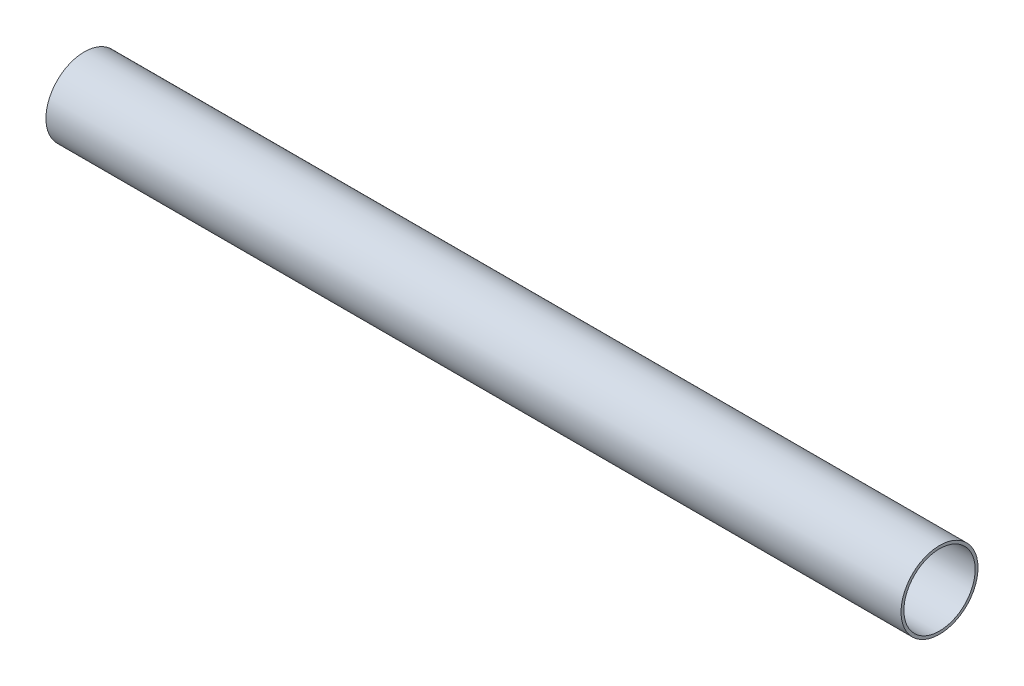
ISO-10303-21;
HEADER;
FILE_DESCRIPTION(('STEP AP214'),'2;1');
FILE_NAME('part.step','',(''),(''),'','','');
FILE_SCHEMA(('AUTOMOTIVE_DESIGN { 1 0 10303 214 1 1 1 1 }'));
ENDSEC;
DATA;
#1=APPLICATION_CONTEXT('core data for automotive mechanical design processes');
#2=APPLICATION_PROTOCOL_DEFINITION('international standard','automotive_design',2000,#1);
#3=PRODUCT_CONTEXT('',#1,'mechanical');
#4=PRODUCT('Part','Part','',(#3));
#5=PRODUCT_RELATED_PRODUCT_CATEGORY('part','',(#4));
#6=PRODUCT_DEFINITION_FORMATION('','',#4);
#7=PRODUCT_DEFINITION_CONTEXT('part definition',#1,'design');
#8=PRODUCT_DEFINITION('design','',#6,#7);
#9=PRODUCT_DEFINITION_SHAPE('','',#8);
#10=(LENGTH_UNIT() NAMED_UNIT(*) SI_UNIT(.MILLI.,.METRE.));
#11=(NAMED_UNIT(*) PLANE_ANGLE_UNIT() SI_UNIT($,.RADIAN.));
#12=(NAMED_UNIT(*) SI_UNIT($,.STERADIAN.) SOLID_ANGLE_UNIT());
#13=UNCERTAINTY_MEASURE_WITH_UNIT(LENGTH_MEASURE(1.E-05),#10,'distance_accuracy_value','');
#14=(GEOMETRIC_REPRESENTATION_CONTEXT(3) GLOBAL_UNCERTAINTY_ASSIGNED_CONTEXT((#13)) GLOBAL_UNIT_ASSIGNED_CONTEXT((#10,
#11,#12)) REPRESENTATION_CONTEXT('',''));
#15=CARTESIAN_POINT('',(0.,0.,0.));
#16=DIRECTION('',(0.,0.,1.));
#17=DIRECTION('',(1.,0.,0.));
#18=AXIS2_PLACEMENT_3D('',#15,#16,#17);
#19=CARTESIAN_POINT('',(0.,0.,0.));
#20=DIRECTION('',(1.,0.,0.));
#21=DIRECTION('',(0.,0.,-1.));
#22=AXIS2_PLACEMENT_3D('',#19,#20,#21);
#23=PLANE('',#22);
#24=CARTESIAN_POINT('',(0.,0.,0.));
#25=DIRECTION('',(1.,0.,0.));
#26=DIRECTION('',(0.,0.,-1.));
#27=AXIS2_PLACEMENT_3D('',#24,#25,#26);
#28=CIRCLE('',#27,12.5);
#29=CARTESIAN_POINT('',(0.,0.,-12.5));
#30=VERTEX_POINT('',#29);
#31=EDGE_CURVE('E54',#30,#30,#28,.T.);
#32=ORIENTED_EDGE('',*,*,#31,.T.);
#33=EDGE_LOOP('',(#32));
#34=FACE_BOUND('',#33,.T.);
#35=CARTESIAN_POINT('',(0.,0.,0.));
#36=DIRECTION('',(1.,0.,0.));
#37=DIRECTION('',(0.,0.,-1.));
#38=AXIS2_PLACEMENT_3D('',#35,#36,#37);
#39=CIRCLE('',#38,13.5);
#40=CARTESIAN_POINT('',(0.,0.,-13.5));
#41=VERTEX_POINT('',#40);
#42=EDGE_CURVE('E43',#41,#41,#39,.T.);
#43=ORIENTED_EDGE('',*,*,#42,.F.);
#44=EDGE_LOOP('',(#43));
#45=FACE_BOUND('',#44,.T.);
#46=ADVANCED_FACE('F39',(#34,#45),#23,.F.);
#47=CARTESIAN_POINT('',(300.,0.,0.));
#48=DIRECTION('',(1.,0.,0.));
#49=DIRECTION('',(0.,0.,-1.));
#50=AXIS2_PLACEMENT_3D('',#47,#48,#49);
#51=PLANE('',#50);
#52=CARTESIAN_POINT('',(300.,0.,0.));
#53=DIRECTION('',(1.,0.,0.));
#54=DIRECTION('',(0.,0.,-1.));
#55=AXIS2_PLACEMENT_3D('',#52,#53,#54);
#56=CIRCLE('',#55,12.5);
#57=CARTESIAN_POINT('',(300.,0.,-12.5));
#58=VERTEX_POINT('',#57);
#59=EDGE_CURVE('E50',#58,#58,#56,.T.);
#60=ORIENTED_EDGE('',*,*,#59,.F.);
#61=EDGE_LOOP('',(#60));
#62=FACE_BOUND('',#61,.T.);
#63=CARTESIAN_POINT('',(300.,0.,0.));
#64=DIRECTION('',(1.,0.,0.));
#65=DIRECTION('',(0.,0.,-1.));
#66=AXIS2_PLACEMENT_3D('',#63,#64,#65);
#67=CIRCLE('',#66,13.5);
#68=CARTESIAN_POINT('',(300.,0.,-13.5));
#69=VERTEX_POINT('',#68);
#70=EDGE_CURVE('E11',#69,#69,#67,.T.);
#71=ORIENTED_EDGE('',*,*,#70,.T.);
#72=EDGE_LOOP('',(#71));
#73=FACE_BOUND('',#72,.T.);
#74=ADVANCED_FACE('F67',(#62,#73),#51,.T.);
#75=CARTESIAN_POINT('',(0.,0.,0.));
#76=DIRECTION('',(1.,0.,0.));
#77=DIRECTION('',(0.,0.,-1.));
#78=AXIS2_PLACEMENT_3D('',#75,#76,#77);
#79=CYLINDRICAL_SURFACE('',#78,13.5);
#80=ORIENTED_EDGE('',*,*,#70,.F.);
#81=EDGE_LOOP('',(#80));
#82=FACE_BOUND('',#81,.T.);
#83=ORIENTED_EDGE('',*,*,#42,.T.);
#84=EDGE_LOOP('',(#83));
#85=FACE_BOUND('',#84,.T.);
#86=ADVANCED_FACE('F41',(#82,#85),#79,.T.);
#87=CARTESIAN_POINT('',(0.,0.,0.));
#88=DIRECTION('',(1.,0.,0.));
#89=DIRECTION('',(0.,0.,-1.));
#90=AXIS2_PLACEMENT_3D('',#87,#88,#89);
#91=CYLINDRICAL_SURFACE('',#90,12.5);
#92=ORIENTED_EDGE('',*,*,#59,.T.);
#93=EDGE_LOOP('',(#92));
#94=FACE_BOUND('',#93,.T.);
#95=ORIENTED_EDGE('',*,*,#31,.F.);
#96=EDGE_LOOP('',(#95));
#97=FACE_BOUND('',#96,.T.);
#98=ADVANCED_FACE('F60',(#94,#97),#91,.F.);
#99=CLOSED_SHELL('',(#46,#74,#86,#98));
#100=MANIFOLD_SOLID_BREP('B2',#99);
#101=ADVANCED_BREP_SHAPE_REPRESENTATION('',(#18,#100),#14);
#102=SHAPE_DEFINITION_REPRESENTATION(#9,#101);
ENDSEC;
END-ISO-10303-21;
